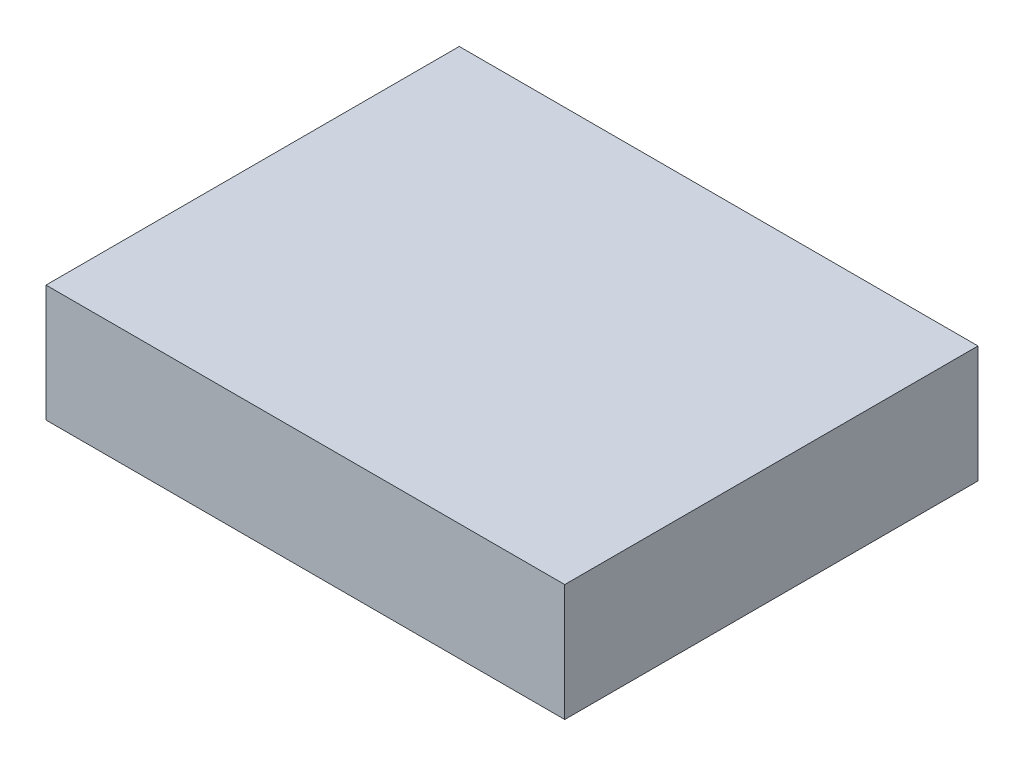
ISO-10303-21;
HEADER;
FILE_DESCRIPTION(('STEP AP214'),'2;1');
FILE_NAME('part.step','',(''),(''),'','','');
FILE_SCHEMA(('AUTOMOTIVE_DESIGN { 1 0 10303 214 1 1 1 1 }'));
ENDSEC;
DATA;
#1=APPLICATION_CONTEXT('core data for automotive mechanical design processes');
#2=APPLICATION_PROTOCOL_DEFINITION('international standard','automotive_design',2000,#1);
#3=PRODUCT_CONTEXT('',#1,'mechanical');
#4=PRODUCT('Part','Part','',(#3));
#5=PRODUCT_RELATED_PRODUCT_CATEGORY('part','',(#4));
#6=PRODUCT_DEFINITION_FORMATION('','',#4);
#7=PRODUCT_DEFINITION_CONTEXT('part definition',#1,'design');
#8=PRODUCT_DEFINITION('design','',#6,#7);
#9=PRODUCT_DEFINITION_SHAPE('','',#8);
#10=(LENGTH_UNIT() NAMED_UNIT(*) SI_UNIT(.MILLI.,.METRE.));
#11=(NAMED_UNIT(*) PLANE_ANGLE_UNIT() SI_UNIT($,.RADIAN.));
#12=(NAMED_UNIT(*) SI_UNIT($,.STERADIAN.) SOLID_ANGLE_UNIT());
#13=UNCERTAINTY_MEASURE_WITH_UNIT(LENGTH_MEASURE(1.E-05),#10,'distance_accuracy_value','');
#14=(GEOMETRIC_REPRESENTATION_CONTEXT(3) GLOBAL_UNCERTAINTY_ASSIGNED_CONTEXT((#13)) GLOBAL_UNIT_ASSIGNED_CONTEXT((#10,
#11,#12)) REPRESENTATION_CONTEXT('',''));
#15=CARTESIAN_POINT('',(0.,0.,0.));
#16=DIRECTION('',(0.,0.,1.));
#17=DIRECTION('',(1.,0.,0.));
#18=AXIS2_PLACEMENT_3D('',#15,#16,#17);
#19=CARTESIAN_POINT('',(47.7,21.5,38.));
#20=DIRECTION('',(-1.,0.,0.));
#21=DIRECTION('',(0.,0.,1.));
#22=AXIS2_PLACEMENT_3D('',#19,#20,#21);
#23=PLANE('',#22);
#24=DIRECTION('',(0.,0.,-1.));
#25=VECTOR('',#24,1.);
#26=CARTESIAN_POINT('',(47.7,0.,38.));
#27=LINE('',#26,#25);
#28=CARTESIAN_POINT('',(47.7,0.,38.));
#29=VERTEX_POINT('',#28);
#30=CARTESIAN_POINT('',(47.7,0.,-38.));
#31=VERTEX_POINT('',#30);
#32=EDGE_CURVE('E104',#29,#31,#27,.T.);
#33=ORIENTED_EDGE('',*,*,#32,.T.);
#34=DIRECTION('',(0.,-1.,0.));
#35=VECTOR('',#34,1.);
#36=CARTESIAN_POINT('',(47.7,21.5,-38.));
#37=LINE('',#36,#35);
#38=CARTESIAN_POINT('',(47.7,21.5,-38.));
#39=VERTEX_POINT('',#38);
#40=EDGE_CURVE('E11',#39,#31,#37,.T.);
#41=ORIENTED_EDGE('',*,*,#40,.F.);
#42=DIRECTION('',(0.,0.,-1.));
#43=VECTOR('',#42,1.);
#44=CARTESIAN_POINT('',(47.7,21.5,38.));
#45=LINE('',#44,#43);
#46=CARTESIAN_POINT('',(47.7,21.5,38.));
#47=VERTEX_POINT('',#46);
#48=EDGE_CURVE('E92',#47,#39,#45,.T.);
#49=ORIENTED_EDGE('',*,*,#48,.F.);
#50=DIRECTION('',(0.,-1.,0.));
#51=VECTOR('',#50,1.);
#52=CARTESIAN_POINT('',(47.7,21.5,38.));
#53=LINE('',#52,#51);
#54=EDGE_CURVE('E100',#47,#29,#53,.T.);
#55=ORIENTED_EDGE('',*,*,#54,.T.);
#56=EDGE_LOOP('',(#33,#41,#49,#55));
#57=FACE_BOUND('',#56,.T.);
#58=ADVANCED_FACE('F41',(#57),#23,.F.);
#59=CARTESIAN_POINT('',(-47.7,21.5,-38.));
#60=DIRECTION('',(0.,0.,1.));
#61=DIRECTION('',(1.,0.,0.));
#62=AXIS2_PLACEMENT_3D('',#59,#60,#61);
#63=PLANE('',#62);
#64=DIRECTION('',(-1.,0.,0.));
#65=VECTOR('',#64,1.);
#66=CARTESIAN_POINT('',(-47.7,0.,-38.));
#67=LINE('',#66,#65);
#68=CARTESIAN_POINT('',(-47.7,0.,-38.));
#69=VERTEX_POINT('',#68);
#70=EDGE_CURVE('E96',#31,#69,#67,.T.);
#71=ORIENTED_EDGE('',*,*,#70,.T.);
#72=DIRECTION('',(0.,-1.,0.));
#73=VECTOR('',#72,1.);
#74=CARTESIAN_POINT('',(-47.7,21.5,-38.));
#75=LINE('',#74,#73);
#76=CARTESIAN_POINT('',(-47.7,21.5,-38.));
#77=VERTEX_POINT('',#76);
#78=EDGE_CURVE('E49',#77,#69,#75,.T.);
#79=ORIENTED_EDGE('',*,*,#78,.F.);
#80=DIRECTION('',(-1.,0.,0.));
#81=VECTOR('',#80,1.);
#82=CARTESIAN_POINT('',(-47.7,21.5,-38.));
#83=LINE('',#82,#81);
#84=EDGE_CURVE('E87',#39,#77,#83,.T.);
#85=ORIENTED_EDGE('',*,*,#84,.F.);
#86=ORIENTED_EDGE('',*,*,#40,.T.);
#87=EDGE_LOOP('',(#71,#79,#85,#86));
#88=FACE_BOUND('',#87,.T.);
#89=ADVANCED_FACE('F95',(#88),#63,.F.);
#90=CARTESIAN_POINT('',(-47.7,21.5,38.));
#91=DIRECTION('',(1.,0.,0.));
#92=DIRECTION('',(0.,0.,-1.));
#93=AXIS2_PLACEMENT_3D('',#90,#91,#92);
#94=PLANE('',#93);
#95=DIRECTION('',(0.,0.,1.));
#96=VECTOR('',#95,1.);
#97=CARTESIAN_POINT('',(-47.7,0.,38.));
#98=LINE('',#97,#96);
#99=CARTESIAN_POINT('',(-47.7,0.,38.));
#100=VERTEX_POINT('',#99);
#101=EDGE_CURVE('E74',#69,#100,#98,.T.);
#102=ORIENTED_EDGE('',*,*,#101,.T.);
#103=DIRECTION('',(0.,-1.,0.));
#104=VECTOR('',#103,1.);
#105=CARTESIAN_POINT('',(-47.7,21.5,38.));
#106=LINE('',#105,#104);
#107=CARTESIAN_POINT('',(-47.7,21.5,38.));
#108=VERTEX_POINT('',#107);
#109=EDGE_CURVE('E97',#108,#100,#106,.T.);
#110=ORIENTED_EDGE('',*,*,#109,.F.);
#111=DIRECTION('',(0.,0.,1.));
#112=VECTOR('',#111,1.);
#113=CARTESIAN_POINT('',(-47.7,21.5,38.));
#114=LINE('',#113,#112);
#115=EDGE_CURVE('E90',#77,#108,#114,.T.);
#116=ORIENTED_EDGE('',*,*,#115,.F.);
#117=ORIENTED_EDGE('',*,*,#78,.T.);
#118=EDGE_LOOP('',(#102,#110,#116,#117));
#119=FACE_BOUND('',#118,.T.);
#120=ADVANCED_FACE('F98',(#119),#94,.F.);
#121=CARTESIAN_POINT('',(-47.7,21.5,38.));
#122=DIRECTION('',(0.,0.,-1.));
#123=DIRECTION('',(-1.,0.,0.));
#124=AXIS2_PLACEMENT_3D('',#121,#122,#123);
#125=PLANE('',#124);
#126=DIRECTION('',(1.,0.,0.));
#127=VECTOR('',#126,1.);
#128=CARTESIAN_POINT('',(-47.7,0.,38.));
#129=LINE('',#128,#127);
#130=EDGE_CURVE('E80',#100,#29,#129,.T.);
#131=ORIENTED_EDGE('',*,*,#130,.T.);
#132=ORIENTED_EDGE('',*,*,#54,.F.);
#133=DIRECTION('',(1.,0.,0.));
#134=VECTOR('',#133,1.);
#135=CARTESIAN_POINT('',(-47.7,21.5,38.));
#136=LINE('',#135,#134);
#137=EDGE_CURVE('E57',#108,#47,#136,.T.);
#138=ORIENTED_EDGE('',*,*,#137,.F.);
#139=ORIENTED_EDGE('',*,*,#109,.T.);
#140=EDGE_LOOP('',(#131,#132,#138,#139));
#141=FACE_BOUND('',#140,.T.);
#142=ADVANCED_FACE('F111',(#141),#125,.F.);
#143=CARTESIAN_POINT('',(0.,21.5,0.));
#144=DIRECTION('',(0.,-1.,0.));
#145=DIRECTION('',(0.,0.,-1.));
#146=AXIS2_PLACEMENT_3D('',#143,#144,#145);
#147=PLANE('',#146);
#148=ORIENTED_EDGE('',*,*,#48,.T.);
#149=ORIENTED_EDGE('',*,*,#84,.T.);
#150=ORIENTED_EDGE('',*,*,#115,.T.);
#151=ORIENTED_EDGE('',*,*,#137,.T.);
#152=EDGE_LOOP('',(#148,#149,#150,#151));
#153=FACE_BOUND('',#152,.T.);
#154=ADVANCED_FACE('F88',(#153),#147,.F.);
#155=CARTESIAN_POINT('',(0.,0.,0.));
#156=DIRECTION('',(0.,-1.,0.));
#157=DIRECTION('',(0.,0.,-1.));
#158=AXIS2_PLACEMENT_3D('',#155,#156,#157);
#159=PLANE('',#158);
#160=ORIENTED_EDGE('',*,*,#32,.F.);
#161=ORIENTED_EDGE('',*,*,#130,.F.);
#162=ORIENTED_EDGE('',*,*,#101,.F.);
#163=ORIENTED_EDGE('',*,*,#70,.F.);
#164=EDGE_LOOP('',(#160,#161,#162,#163));
#165=FACE_BOUND('',#164,.T.);
#166=ADVANCED_FACE('F114',(#165),#159,.T.);
#167=CLOSED_SHELL('',(#58,#89,#120,#142,#154,#166));
#168=MANIFOLD_SOLID_BREP('B2',#167);
#169=ADVANCED_BREP_SHAPE_REPRESENTATION('',(#18,#168),#14);
#170=SHAPE_DEFINITION_REPRESENTATION(#9,#169);
ENDSEC;
END-ISO-10303-21;
